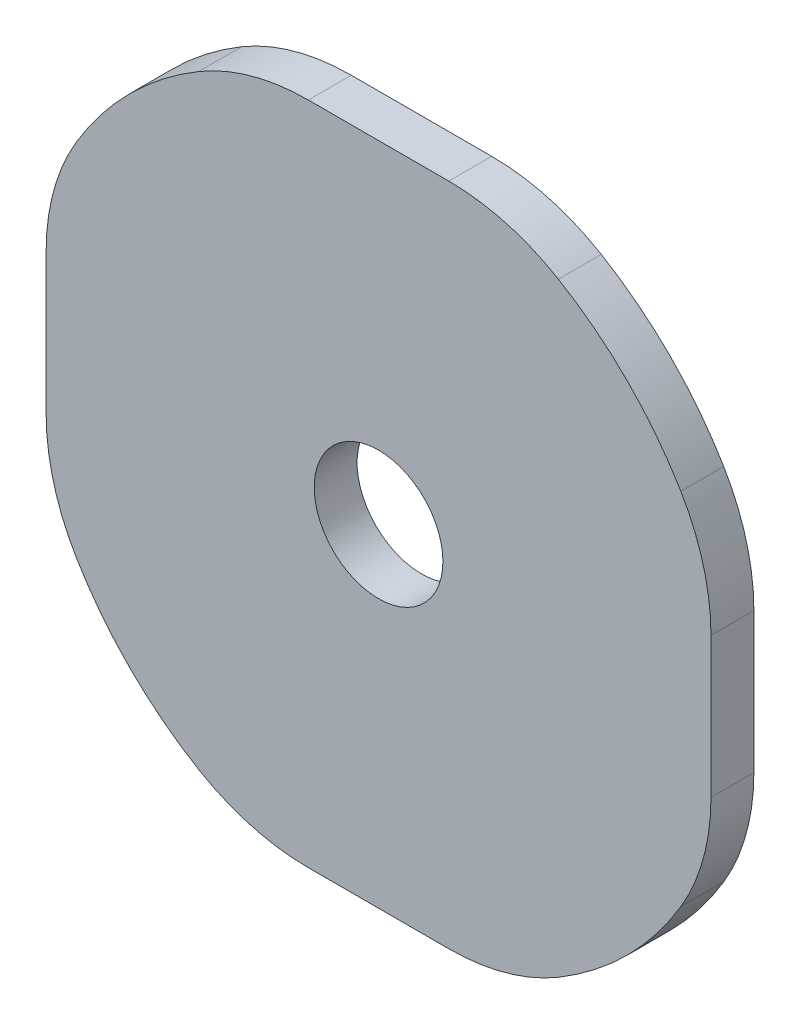
ISO-10303-21;
HEADER;
FILE_DESCRIPTION(('STEP AP214'),'2;1');
FILE_NAME('part.step','',(''),(''),'','','');
FILE_SCHEMA(('AUTOMOTIVE_DESIGN { 1 0 10303 214 1 1 1 1 }'));
ENDSEC;
DATA;
#1=APPLICATION_CONTEXT('core data for automotive mechanical design processes');
#2=APPLICATION_PROTOCOL_DEFINITION('international standard','automotive_design',2000,#1);
#3=PRODUCT_CONTEXT('',#1,'mechanical');
#4=PRODUCT('Part','Part','',(#3));
#5=PRODUCT_RELATED_PRODUCT_CATEGORY('part','',(#4));
#6=PRODUCT_DEFINITION_FORMATION('','',#4);
#7=PRODUCT_DEFINITION_CONTEXT('part definition',#1,'design');
#8=PRODUCT_DEFINITION('design','',#6,#7);
#9=PRODUCT_DEFINITION_SHAPE('','',#8);
#10=(LENGTH_UNIT() NAMED_UNIT(*) SI_UNIT(.MILLI.,.METRE.));
#11=(NAMED_UNIT(*) PLANE_ANGLE_UNIT() SI_UNIT($,.RADIAN.));
#12=(NAMED_UNIT(*) SI_UNIT($,.STERADIAN.) SOLID_ANGLE_UNIT());
#13=UNCERTAINTY_MEASURE_WITH_UNIT(LENGTH_MEASURE(1.E-05),#10,'distance_accuracy_value','');
#14=(GEOMETRIC_REPRESENTATION_CONTEXT(3) GLOBAL_UNCERTAINTY_ASSIGNED_CONTEXT((#13)) GLOBAL_UNIT_ASSIGNED_CONTEXT((#10,
#11,#12)) REPRESENTATION_CONTEXT('',''));
#15=CARTESIAN_POINT('',(0.,0.,0.));
#16=DIRECTION('',(0.,0.,1.));
#17=DIRECTION('',(1.,0.,0.));
#18=AXIS2_PLACEMENT_3D('',#15,#16,#17);
#19=CARTESIAN_POINT('',(0.,0.,2.));
#20=DIRECTION('',(0.,0.,-1.));
#21=DIRECTION('',(-1.,0.,0.));
#22=AXIS2_PLACEMENT_3D('',#19,#20,#21);
#23=CYLINDRICAL_SURFACE('',#22,16.4);
#24=CARTESIAN_POINT('',(0.,0.,2.));
#25=DIRECTION('',(0.,0.,1.));
#26=DIRECTION('',(1.,0.,0.));
#27=AXIS2_PLACEMENT_3D('',#24,#25,#26);
#28=CIRCLE('',#27,16.4);
#29=CARTESIAN_POINT('',(8.3860724381262,-14.09375,2.));
#30=VERTEX_POINT('',#29);
#31=CARTESIAN_POINT('',(14.09375,-8.3860724381262,2.));
#32=VERTEX_POINT('',#31);
#33=EDGE_CURVE('E269',#30,#32,#28,.T.);
#34=ORIENTED_EDGE('',*,*,#33,.F.);
#35=DIRECTION('',(0.,0.,-1.));
#36=VECTOR('',#35,1.);
#37=CARTESIAN_POINT('',(8.3860724381262,-14.09375,2.));
#38=LINE('',#37,#36);
#39=CARTESIAN_POINT('',(8.3860724381262,-14.09375,0.));
#40=VERTEX_POINT('',#39);
#41=EDGE_CURVE('E237',#30,#40,#38,.T.);
#42=ORIENTED_EDGE('',*,*,#41,.T.);
#43=CARTESIAN_POINT('',(0.,0.,0.));
#44=DIRECTION('',(0.,0.,1.));
#45=DIRECTION('',(1.,0.,0.));
#46=AXIS2_PLACEMENT_3D('',#43,#44,#45);
#47=CIRCLE('',#46,16.4);
#48=CARTESIAN_POINT('',(14.09375,-8.3860724381262,0.));
#49=VERTEX_POINT('',#48);
#50=EDGE_CURVE('E264',#40,#49,#47,.T.);
#51=ORIENTED_EDGE('',*,*,#50,.T.);
#52=DIRECTION('',(0.,0.,-1.));
#53=VECTOR('',#52,1.);
#54=CARTESIAN_POINT('',(14.09375,-8.3860724381262,2.));
#55=LINE('',#54,#53);
#56=EDGE_CURVE('E235',#49,#32,#55,.F.);
#57=ORIENTED_EDGE('',*,*,#56,.T.);
#58=EDGE_LOOP('',(#34,#42,#51,#57));
#59=FACE_BOUND('',#58,.T.);
#60=ADVANCED_FACE('F33',(#59),#23,.T.);
#61=CARTESIAN_POINT('',(14.09375,8.3860724381262,0.));
#62=VERTEX_POINT('',#61);
#63=CARTESIAN_POINT('',(8.3860724381262,14.09375,0.));
#64=VERTEX_POINT('',#63);
#65=EDGE_CURVE('E271',#62,#64,#47,.T.);
#66=ORIENTED_EDGE('',*,*,#65,.T.);
#67=DIRECTION('',(0.,0.,-1.));
#68=VECTOR('',#67,1.);
#69=CARTESIAN_POINT('',(8.3860724381262,14.09375,2.));
#70=LINE('',#69,#68);
#71=CARTESIAN_POINT('',(8.3860724381262,14.09375,2.));
#72=VERTEX_POINT('',#71);
#73=EDGE_CURVE('E154',#64,#72,#70,.F.);
#74=ORIENTED_EDGE('',*,*,#73,.T.);
#75=CARTESIAN_POINT('',(14.09375,8.3860724381262,2.));
#76=VERTEX_POINT('',#75);
#77=EDGE_CURVE('E270',#76,#72,#28,.T.);
#78=ORIENTED_EDGE('',*,*,#77,.F.);
#79=DIRECTION('',(0.,0.,-1.));
#80=VECTOR('',#79,1.);
#81=CARTESIAN_POINT('',(14.09375,8.3860724381262,2.));
#82=LINE('',#81,#80);
#83=EDGE_CURVE('E159',#76,#62,#82,.T.);
#84=ORIENTED_EDGE('',*,*,#83,.T.);
#85=EDGE_LOOP('',(#66,#74,#78,#84));
#86=FACE_BOUND('',#85,.T.);
#87=ADVANCED_FACE('F286',(#86),#23,.T.);
#88=CARTESIAN_POINT('',(-8.3860724381262,14.09375,2.));
#89=VERTEX_POINT('',#88);
#90=CARTESIAN_POINT('',(-14.09375,8.3860724381262,2.));
#91=VERTEX_POINT('',#90);
#92=EDGE_CURVE('E268',#89,#91,#28,.T.);
#93=ORIENTED_EDGE('',*,*,#92,.F.);
#94=DIRECTION('',(0.,0.,-1.));
#95=VECTOR('',#94,1.);
#96=CARTESIAN_POINT('',(-8.3860724381262,14.09375,2.));
#97=LINE('',#96,#95);
#98=CARTESIAN_POINT('',(-8.3860724381262,14.09375,0.));
#99=VERTEX_POINT('',#98);
#100=EDGE_CURVE('E218',#89,#99,#97,.T.);
#101=ORIENTED_EDGE('',*,*,#100,.T.);
#102=CARTESIAN_POINT('',(-14.09375,8.3860724381262,0.));
#103=VERTEX_POINT('',#102);
#104=EDGE_CURVE('E272',#99,#103,#47,.T.);
#105=ORIENTED_EDGE('',*,*,#104,.T.);
#106=DIRECTION('',(0.,0.,-1.));
#107=VECTOR('',#106,1.);
#108=CARTESIAN_POINT('',(-14.09375,8.3860724381262,2.));
#109=LINE('',#108,#107);
#110=EDGE_CURVE('E216',#103,#91,#109,.F.);
#111=ORIENTED_EDGE('',*,*,#110,.T.);
#112=EDGE_LOOP('',(#93,#101,#105,#111));
#113=FACE_BOUND('',#112,.T.);
#114=ADVANCED_FACE('F288',(#113),#23,.T.);
#115=CARTESIAN_POINT('',(-14.09375,-8.3860724381262,2.));
#116=VERTEX_POINT('',#115);
#117=CARTESIAN_POINT('',(-8.3860724381262,-14.09375,2.));
#118=VERTEX_POINT('',#117);
#119=EDGE_CURVE('E266',#116,#118,#28,.T.);
#120=ORIENTED_EDGE('',*,*,#119,.F.);
#121=DIRECTION('',(0.,0.,-1.));
#122=VECTOR('',#121,1.);
#123=CARTESIAN_POINT('',(-14.09375,-8.3860724381262,2.));
#124=LINE('',#123,#122);
#125=CARTESIAN_POINT('',(-14.09375,-8.3860724381262,0.));
#126=VERTEX_POINT('',#125);
#127=EDGE_CURVE('E228',#116,#126,#124,.T.);
#128=ORIENTED_EDGE('',*,*,#127,.T.);
#129=CARTESIAN_POINT('',(-8.3860724381262,-14.09375,0.));
#130=VERTEX_POINT('',#129);
#131=EDGE_CURVE('E465',#126,#130,#47,.T.);
#132=ORIENTED_EDGE('',*,*,#131,.T.);
#133=DIRECTION('',(0.,0.,-1.));
#134=VECTOR('',#133,1.);
#135=CARTESIAN_POINT('',(-8.3860724381262,-14.09375,2.));
#136=LINE('',#135,#134);
#137=EDGE_CURVE('E226',#130,#118,#136,.F.);
#138=ORIENTED_EDGE('',*,*,#137,.T.);
#139=EDGE_LOOP('',(#120,#128,#132,#138));
#140=FACE_BOUND('',#139,.T.);
#141=ADVANCED_FACE('F294',(#140),#23,.T.);
#142=CARTESIAN_POINT('',(0.,0.,2.));
#143=DIRECTION('',(0.,0.,1.));
#144=DIRECTION('',(1.,0.,0.));
#145=AXIS2_PLACEMENT_3D('',#142,#143,#144);
#146=PLANE('',#145);
#147=CARTESIAN_POINT('',(0.,0.,2.));
#148=DIRECTION('',(0.,0.,1.));
#149=DIRECTION('',(1.,0.,0.));
#150=AXIS2_PLACEMENT_3D('',#147,#148,#149);
#151=CIRCLE('',#150,3.);
#152=CARTESIAN_POINT('',(3.,0.,2.));
#153=VERTEX_POINT('',#152);
#154=EDGE_CURVE('E254',#153,#153,#151,.T.);
#155=ORIENTED_EDGE('',*,*,#154,.F.);
#156=EDGE_LOOP('',(#155));
#157=FACE_BOUND('',#156,.T.);
#158=ORIENTED_EDGE('',*,*,#77,.T.);
#159=CARTESIAN_POINT('',(3.27261363439071,5.5,2.));
#160=DIRECTION('',(0.,0.,1.));
#161=DIRECTION('',(1.,0.,0.));
#162=AXIS2_PLACEMENT_3D('',#159,#160,#161);
#163=CIRCLE('',#162,10.);
#164=CARTESIAN_POINT('',(3.27261363439071,15.5,2.));
#165=VERTEX_POINT('',#164);
#166=EDGE_CURVE('E214',#72,#165,#163,.T.);
#167=ORIENTED_EDGE('',*,*,#166,.T.);
#168=DIRECTION('',(-1.,0.,0.));
#169=VECTOR('',#168,1.);
#170=CARTESIAN_POINT('',(0.,15.5,2.));
#171=LINE('',#170,#169);
#172=CARTESIAN_POINT('',(-3.27261363439071,15.5,2.));
#173=VERTEX_POINT('',#172);
#174=EDGE_CURVE('E170',#165,#173,#171,.T.);
#175=ORIENTED_EDGE('',*,*,#174,.T.);
#176=CARTESIAN_POINT('',(-3.27261363439071,5.5,2.));
#177=DIRECTION('',(0.,0.,1.));
#178=DIRECTION('',(1.,0.,0.));
#179=AXIS2_PLACEMENT_3D('',#176,#177,#178);
#180=CIRCLE('',#179,10.);
#181=EDGE_CURVE('E212',#173,#89,#180,.T.);
#182=ORIENTED_EDGE('',*,*,#181,.T.);
#183=ORIENTED_EDGE('',*,*,#92,.T.);
#184=CARTESIAN_POINT('',(-5.5,3.27261363439071,2.));
#185=DIRECTION('',(0.,0.,1.));
#186=DIRECTION('',(1.,0.,0.));
#187=AXIS2_PLACEMENT_3D('',#184,#185,#186);
#188=CIRCLE('',#187,10.);
#189=CARTESIAN_POINT('',(-15.5,3.27261363439071,2.));
#190=VERTEX_POINT('',#189);
#191=EDGE_CURVE('E210',#91,#190,#188,.T.);
#192=ORIENTED_EDGE('',*,*,#191,.T.);
#193=DIRECTION('',(0.,-1.,0.));
#194=VECTOR('',#193,1.);
#195=CARTESIAN_POINT('',(-15.5,0.,2.));
#196=LINE('',#195,#194);
#197=CARTESIAN_POINT('',(-15.5,-3.27261363439071,2.));
#198=VERTEX_POINT('',#197);
#199=EDGE_CURVE('E259',#190,#198,#196,.T.);
#200=ORIENTED_EDGE('',*,*,#199,.T.);
#201=CARTESIAN_POINT('',(-5.5,-3.27261363439071,2.));
#202=DIRECTION('',(0.,0.,1.));
#203=DIRECTION('',(1.,0.,0.));
#204=AXIS2_PLACEMENT_3D('',#201,#202,#203);
#205=CIRCLE('',#204,10.);
#206=EDGE_CURVE('E208',#198,#116,#205,.T.);
#207=ORIENTED_EDGE('',*,*,#206,.T.);
#208=ORIENTED_EDGE('',*,*,#119,.T.);
#209=CARTESIAN_POINT('',(-3.27261363439071,-5.5,2.));
#210=DIRECTION('',(0.,0.,1.));
#211=DIRECTION('',(1.,0.,0.));
#212=AXIS2_PLACEMENT_3D('',#209,#210,#211);
#213=CIRCLE('',#212,10.);
#214=CARTESIAN_POINT('',(-3.27261363439071,-15.5,2.));
#215=VERTEX_POINT('',#214);
#216=EDGE_CURVE('E56',#118,#215,#213,.T.);
#217=ORIENTED_EDGE('',*,*,#216,.T.);
#218=DIRECTION('',(1.,0.,0.));
#219=VECTOR('',#218,1.);
#220=CARTESIAN_POINT('',(0.,-15.5,2.));
#221=LINE('',#220,#219);
#222=CARTESIAN_POINT('',(3.27261363439071,-15.5,2.));
#223=VERTEX_POINT('',#222);
#224=EDGE_CURVE('E475',#215,#223,#221,.T.);
#225=ORIENTED_EDGE('',*,*,#224,.T.);
#226=CARTESIAN_POINT('',(3.27261363439071,-5.5,2.));
#227=DIRECTION('',(0.,0.,1.));
#228=DIRECTION('',(1.,0.,0.));
#229=AXIS2_PLACEMENT_3D('',#226,#227,#228);
#230=CIRCLE('',#229,10.);
#231=EDGE_CURVE('E48',#223,#30,#230,.T.);
#232=ORIENTED_EDGE('',*,*,#231,.T.);
#233=ORIENTED_EDGE('',*,*,#33,.T.);
#234=CARTESIAN_POINT('',(5.5,-3.27261363439071,2.));
#235=DIRECTION('',(0.,0.,1.));
#236=DIRECTION('',(1.,0.,0.));
#237=AXIS2_PLACEMENT_3D('',#234,#235,#236);
#238=CIRCLE('',#237,10.);
#239=CARTESIAN_POINT('',(15.5,-3.27261363439071,2.));
#240=VERTEX_POINT('',#239);
#241=EDGE_CURVE('E204',#32,#240,#238,.T.);
#242=ORIENTED_EDGE('',*,*,#241,.T.);
#243=DIRECTION('',(0.,1.,0.));
#244=VECTOR('',#243,1.);
#245=CARTESIAN_POINT('',(15.5,0.,2.));
#246=LINE('',#245,#244);
#247=CARTESIAN_POINT('',(15.5,3.27261363439071,2.));
#248=VERTEX_POINT('',#247);
#249=EDGE_CURVE('E244',#240,#248,#246,.T.);
#250=ORIENTED_EDGE('',*,*,#249,.T.);
#251=CARTESIAN_POINT('',(5.5,3.27261363439071,2.));
#252=DIRECTION('',(0.,0.,1.));
#253=DIRECTION('',(1.,0.,0.));
#254=AXIS2_PLACEMENT_3D('',#251,#252,#253);
#255=CIRCLE('',#254,10.);
#256=EDGE_CURVE('E202',#248,#76,#255,.T.);
#257=ORIENTED_EDGE('',*,*,#256,.T.);
#258=EDGE_LOOP('',(#158,#167,#175,#182,#183,#192,#200,#207,#208,#217,#225,#232,#233,#242,#250,#257));
#259=FACE_BOUND('',#258,.T.);
#260=ADVANCED_FACE('F250',(#157,#259),#146,.T.);
#261=CARTESIAN_POINT('',(0.,0.,0.));
#262=DIRECTION('',(0.,0.,1.));
#263=DIRECTION('',(1.,0.,0.));
#264=AXIS2_PLACEMENT_3D('',#261,#262,#263);
#265=PLANE('',#264);
#266=CARTESIAN_POINT('',(0.,0.,0.));
#267=DIRECTION('',(0.,0.,1.));
#268=DIRECTION('',(1.,0.,0.));
#269=AXIS2_PLACEMENT_3D('',#266,#267,#268);
#270=CIRCLE('',#269,3.);
#271=CARTESIAN_POINT('',(3.,0.,0.));
#272=VERTEX_POINT('',#271);
#273=EDGE_CURVE('E257',#272,#272,#270,.T.);
#274=ORIENTED_EDGE('',*,*,#273,.T.);
#275=EDGE_LOOP('',(#274));
#276=FACE_BOUND('',#275,.T.);
#277=DIRECTION('',(-1.,0.,0.));
#278=VECTOR('',#277,1.);
#279=CARTESIAN_POINT('',(0.,15.5,0.));
#280=LINE('',#279,#278);
#281=CARTESIAN_POINT('',(3.27261363439071,15.5,0.));
#282=VERTEX_POINT('',#281);
#283=CARTESIAN_POINT('',(-3.27261363439071,15.5,0.));
#284=VERTEX_POINT('',#283);
#285=EDGE_CURVE('E167',#282,#284,#280,.T.);
#286=ORIENTED_EDGE('',*,*,#285,.F.);
#287=CARTESIAN_POINT('',(3.27261363439071,5.5,0.));
#288=DIRECTION('',(0.,0.,1.));
#289=DIRECTION('',(1.,0.,0.));
#290=AXIS2_PLACEMENT_3D('',#287,#288,#289);
#291=CIRCLE('',#290,10.);
#292=EDGE_CURVE('E149',#282,#64,#291,.F.);
#293=ORIENTED_EDGE('',*,*,#292,.T.);
#294=ORIENTED_EDGE('',*,*,#65,.F.);
#295=CARTESIAN_POINT('',(5.5,3.27261363439071,0.));
#296=DIRECTION('',(0.,0.,1.));
#297=DIRECTION('',(1.,0.,0.));
#298=AXIS2_PLACEMENT_3D('',#295,#296,#297);
#299=CIRCLE('',#298,10.);
#300=CARTESIAN_POINT('',(15.5,3.27261363439071,0.));
#301=VERTEX_POINT('',#300);
#302=EDGE_CURVE('E171',#62,#301,#299,.F.);
#303=ORIENTED_EDGE('',*,*,#302,.T.);
#304=DIRECTION('',(0.,1.,0.));
#305=VECTOR('',#304,1.);
#306=CARTESIAN_POINT('',(15.5,0.,0.));
#307=LINE('',#306,#305);
#308=CARTESIAN_POINT('',(15.5,-3.27261363439071,0.));
#309=VERTEX_POINT('',#308);
#310=EDGE_CURVE('E177',#309,#301,#307,.T.);
#311=ORIENTED_EDGE('',*,*,#310,.F.);
#312=CARTESIAN_POINT('',(5.5,-3.27261363439071,0.));
#313=DIRECTION('',(0.,0.,1.));
#314=DIRECTION('',(1.,0.,0.));
#315=AXIS2_PLACEMENT_3D('',#312,#313,#314);
#316=CIRCLE('',#315,10.);
#317=EDGE_CURVE('E189',#309,#49,#316,.F.);
#318=ORIENTED_EDGE('',*,*,#317,.T.);
#319=ORIENTED_EDGE('',*,*,#50,.F.);
#320=CARTESIAN_POINT('',(3.27261363439071,-5.5,0.));
#321=DIRECTION('',(0.,0.,1.));
#322=DIRECTION('',(1.,0.,0.));
#323=AXIS2_PLACEMENT_3D('',#320,#321,#322);
#324=CIRCLE('',#323,10.);
#325=CARTESIAN_POINT('',(3.27261363439071,-15.5,0.));
#326=VERTEX_POINT('',#325);
#327=EDGE_CURVE('E191',#40,#326,#324,.F.);
#328=ORIENTED_EDGE('',*,*,#327,.T.);
#329=DIRECTION('',(1.,0.,0.));
#330=VECTOR('',#329,1.);
#331=CARTESIAN_POINT('',(0.,-15.5,0.));
#332=LINE('',#331,#330);
#333=CARTESIAN_POINT('',(-3.27261363439071,-15.5,0.));
#334=VERTEX_POINT('',#333);
#335=EDGE_CURVE('E183',#334,#326,#332,.T.);
#336=ORIENTED_EDGE('',*,*,#335,.F.);
#337=CARTESIAN_POINT('',(-3.27261363439071,-5.5,0.));
#338=DIRECTION('',(0.,0.,1.));
#339=DIRECTION('',(1.,0.,0.));
#340=AXIS2_PLACEMENT_3D('',#337,#338,#339);
#341=CIRCLE('',#340,10.);
#342=EDGE_CURVE('E193',#334,#130,#341,.F.);
#343=ORIENTED_EDGE('',*,*,#342,.T.);
#344=ORIENTED_EDGE('',*,*,#131,.F.);
#345=CARTESIAN_POINT('',(-5.5,-3.27261363439071,0.));
#346=DIRECTION('',(0.,0.,1.));
#347=DIRECTION('',(1.,0.,0.));
#348=AXIS2_PLACEMENT_3D('',#345,#346,#347);
#349=CIRCLE('',#348,10.);
#350=CARTESIAN_POINT('',(-15.5,-3.27261363439071,0.));
#351=VERTEX_POINT('',#350);
#352=EDGE_CURVE('E195',#126,#351,#349,.F.);
#353=ORIENTED_EDGE('',*,*,#352,.T.);
#354=DIRECTION('',(0.,-1.,0.));
#355=VECTOR('',#354,1.);
#356=CARTESIAN_POINT('',(-15.5,0.,0.));
#357=LINE('',#356,#355);
#358=CARTESIAN_POINT('',(-15.5,3.27261363439071,0.));
#359=VERTEX_POINT('',#358);
#360=EDGE_CURVE('E178',#359,#351,#357,.T.);
#361=ORIENTED_EDGE('',*,*,#360,.F.);
#362=CARTESIAN_POINT('',(-5.5,3.27261363439071,0.));
#363=DIRECTION('',(0.,0.,1.));
#364=DIRECTION('',(1.,0.,0.));
#365=AXIS2_PLACEMENT_3D('',#362,#363,#364);
#366=CIRCLE('',#365,10.);
#367=EDGE_CURVE('E197',#359,#103,#366,.F.);
#368=ORIENTED_EDGE('',*,*,#367,.T.);
#369=ORIENTED_EDGE('',*,*,#104,.F.);
#370=CARTESIAN_POINT('',(-3.27261363439071,5.5,0.));
#371=DIRECTION('',(0.,0.,1.));
#372=DIRECTION('',(1.,0.,0.));
#373=AXIS2_PLACEMENT_3D('',#370,#371,#372);
#374=CIRCLE('',#373,10.);
#375=EDGE_CURVE('E160',#99,#284,#374,.F.);
#376=ORIENTED_EDGE('',*,*,#375,.T.);
#377=EDGE_LOOP('',(#286,#293,#294,#303,#311,#318,#319,#328,#336,#343,#344,#353,#361,#368,#369,#376));
#378=FACE_BOUND('',#377,.T.);
#379=ADVANCED_FACE('F174',(#276,#378),#265,.F.);
#380=CARTESIAN_POINT('',(0.,0.,0.));
#381=DIRECTION('',(0.,0.,1.));
#382=DIRECTION('',(1.,0.,0.));
#383=AXIS2_PLACEMENT_3D('',#380,#381,#382);
#384=CYLINDRICAL_SURFACE('',#383,3.);
#385=ORIENTED_EDGE('',*,*,#273,.F.);
#386=EDGE_LOOP('',(#385));
#387=FACE_BOUND('',#386,.T.);
#388=ORIENTED_EDGE('',*,*,#154,.T.);
#389=EDGE_LOOP('',(#388));
#390=FACE_BOUND('',#389,.T.);
#391=ADVANCED_FACE('F401',(#387,#390),#384,.F.);
#392=CARTESIAN_POINT('',(15.5,-15.5,10.));
#393=DIRECTION('',(0.,-1.,0.));
#394=DIRECTION('',(0.,0.,-1.));
#395=AXIS2_PLACEMENT_3D('',#392,#393,#394);
#396=PLANE('',#395);
#397=ORIENTED_EDGE('',*,*,#224,.F.);
#398=DIRECTION('',(0.,0.,1.));
#399=VECTOR('',#398,1.);
#400=CARTESIAN_POINT('',(-3.27261363439071,-15.5,0.));
#401=LINE('',#400,#399);
#402=EDGE_CURVE('E232',#215,#334,#401,.F.);
#403=ORIENTED_EDGE('',*,*,#402,.T.);
#404=ORIENTED_EDGE('',*,*,#335,.T.);
#405=DIRECTION('',(0.,0.,1.));
#406=VECTOR('',#405,1.);
#407=CARTESIAN_POINT('',(3.27261363439071,-15.5,2.));
#408=LINE('',#407,#406);
#409=EDGE_CURVE('E230',#326,#223,#408,.T.);
#410=ORIENTED_EDGE('',*,*,#409,.T.);
#411=EDGE_LOOP('',(#397,#403,#404,#410));
#412=FACE_BOUND('',#411,.T.);
#413=ADVANCED_FACE('F391',(#412),#396,.T.);
#414=CARTESIAN_POINT('',(-15.5,15.5,10.));
#415=DIRECTION('',(-1.,0.,0.));
#416=DIRECTION('',(0.,0.,1.));
#417=AXIS2_PLACEMENT_3D('',#414,#415,#416);
#418=PLANE('',#417);
#419=ORIENTED_EDGE('',*,*,#199,.F.);
#420=DIRECTION('',(0.,0.,1.));
#421=VECTOR('',#420,1.);
#422=CARTESIAN_POINT('',(-15.5,3.27261363439071,0.));
#423=LINE('',#422,#421);
#424=EDGE_CURVE('E223',#190,#359,#423,.F.);
#425=ORIENTED_EDGE('',*,*,#424,.T.);
#426=ORIENTED_EDGE('',*,*,#360,.T.);
#427=DIRECTION('',(0.,0.,1.));
#428=VECTOR('',#427,1.);
#429=CARTESIAN_POINT('',(-15.5,-3.27261363439071,2.));
#430=LINE('',#429,#428);
#431=EDGE_CURVE('E220',#351,#198,#430,.T.);
#432=ORIENTED_EDGE('',*,*,#431,.T.);
#433=EDGE_LOOP('',(#419,#425,#426,#432));
#434=FACE_BOUND('',#433,.T.);
#435=ADVANCED_FACE('F382',(#434),#418,.T.);
#436=CARTESIAN_POINT('',(15.5,15.5,10.));
#437=DIRECTION('',(0.,1.,0.));
#438=DIRECTION('',(0.,0.,1.));
#439=AXIS2_PLACEMENT_3D('',#436,#437,#438);
#440=PLANE('',#439);
#441=ORIENTED_EDGE('',*,*,#174,.F.);
#442=DIRECTION('',(0.,0.,1.));
#443=VECTOR('',#442,1.);
#444=CARTESIAN_POINT('',(3.27261363439071,15.5,0.));
#445=LINE('',#444,#443);
#446=EDGE_CURVE('E153',#165,#282,#445,.F.);
#447=ORIENTED_EDGE('',*,*,#446,.T.);
#448=ORIENTED_EDGE('',*,*,#285,.T.);
#449=DIRECTION('',(0.,0.,1.));
#450=VECTOR('',#449,1.);
#451=CARTESIAN_POINT('',(-3.27261363439071,15.5,2.));
#452=LINE('',#451,#450);
#453=EDGE_CURVE('E172',#284,#173,#452,.T.);
#454=ORIENTED_EDGE('',*,*,#453,.T.);
#455=EDGE_LOOP('',(#441,#447,#448,#454));
#456=FACE_BOUND('',#455,.T.);
#457=ADVANCED_FACE('F165',(#456),#440,.T.);
#458=CARTESIAN_POINT('',(15.5,15.5,10.));
#459=DIRECTION('',(1.,0.,0.));
#460=DIRECTION('',(0.,0.,-1.));
#461=AXIS2_PLACEMENT_3D('',#458,#459,#460);
#462=PLANE('',#461);
#463=ORIENTED_EDGE('',*,*,#249,.F.);
#464=DIRECTION('',(0.,0.,1.));
#465=VECTOR('',#464,1.);
#466=CARTESIAN_POINT('',(15.5,-3.27261363439071,0.));
#467=LINE('',#466,#465);
#468=EDGE_CURVE('E11',#240,#309,#467,.F.);
#469=ORIENTED_EDGE('',*,*,#468,.T.);
#470=ORIENTED_EDGE('',*,*,#310,.T.);
#471=DIRECTION('',(0.,0.,1.));
#472=VECTOR('',#471,1.);
#473=CARTESIAN_POINT('',(15.5,3.27261363439071,2.));
#474=LINE('',#473,#472);
#475=EDGE_CURVE('E41',#301,#248,#474,.T.);
#476=ORIENTED_EDGE('',*,*,#475,.T.);
#477=EDGE_LOOP('',(#463,#469,#470,#476));
#478=FACE_BOUND('',#477,.T.);
#479=ADVANCED_FACE('F243',(#478),#462,.T.);
#480=CARTESIAN_POINT('',(3.27261363439071,5.5,2.));
#481=DIRECTION('',(0.,0.,-1.));
#482=DIRECTION('',(-1.,0.,0.));
#483=AXIS2_PLACEMENT_3D('',#480,#481,#482);
#484=CYLINDRICAL_SURFACE('',#483,10.);
#485=ORIENTED_EDGE('',*,*,#166,.F.);
#486=ORIENTED_EDGE('',*,*,#73,.F.);
#487=ORIENTED_EDGE('',*,*,#292,.F.);
#488=ORIENTED_EDGE('',*,*,#446,.F.);
#489=EDGE_LOOP('',(#485,#486,#487,#488));
#490=FACE_BOUND('',#489,.T.);
#491=ADVANCED_FACE('F152',(#490),#484,.T.);
#492=CARTESIAN_POINT('',(-3.27261363439071,5.5,2.));
#493=DIRECTION('',(0.,0.,-1.));
#494=DIRECTION('',(-1.,0.,0.));
#495=AXIS2_PLACEMENT_3D('',#492,#493,#494);
#496=CYLINDRICAL_SURFACE('',#495,10.);
#497=ORIENTED_EDGE('',*,*,#375,.F.);
#498=ORIENTED_EDGE('',*,*,#100,.F.);
#499=ORIENTED_EDGE('',*,*,#181,.F.);
#500=ORIENTED_EDGE('',*,*,#453,.F.);
#501=EDGE_LOOP('',(#497,#498,#499,#500));
#502=FACE_BOUND('',#501,.T.);
#503=ADVANCED_FACE('F301',(#502),#496,.T.);
#504=CARTESIAN_POINT('',(-5.5,3.27261363439071,2.));
#505=DIRECTION('',(0.,0.,-1.));
#506=DIRECTION('',(-1.,0.,0.));
#507=AXIS2_PLACEMENT_3D('',#504,#505,#506);
#508=CYLINDRICAL_SURFACE('',#507,10.);
#509=ORIENTED_EDGE('',*,*,#191,.F.);
#510=ORIENTED_EDGE('',*,*,#110,.F.);
#511=ORIENTED_EDGE('',*,*,#367,.F.);
#512=ORIENTED_EDGE('',*,*,#424,.F.);
#513=EDGE_LOOP('',(#509,#510,#511,#512));
#514=FACE_BOUND('',#513,.T.);
#515=ADVANCED_FACE('F304',(#514),#508,.T.);
#516=CARTESIAN_POINT('',(-5.5,-3.27261363439071,2.));
#517=DIRECTION('',(0.,0.,-1.));
#518=DIRECTION('',(-1.,0.,0.));
#519=AXIS2_PLACEMENT_3D('',#516,#517,#518);
#520=CYLINDRICAL_SURFACE('',#519,10.);
#521=ORIENTED_EDGE('',*,*,#352,.F.);
#522=ORIENTED_EDGE('',*,*,#127,.F.);
#523=ORIENTED_EDGE('',*,*,#206,.F.);
#524=ORIENTED_EDGE('',*,*,#431,.F.);
#525=EDGE_LOOP('',(#521,#522,#523,#524));
#526=FACE_BOUND('',#525,.T.);
#527=ADVANCED_FACE('F308',(#526),#520,.T.);
#528=CARTESIAN_POINT('',(-3.27261363439071,-5.5,2.));
#529=DIRECTION('',(0.,0.,-1.));
#530=DIRECTION('',(-1.,0.,0.));
#531=AXIS2_PLACEMENT_3D('',#528,#529,#530);
#532=CYLINDRICAL_SURFACE('',#531,10.);
#533=ORIENTED_EDGE('',*,*,#216,.F.);
#534=ORIENTED_EDGE('',*,*,#137,.F.);
#535=ORIENTED_EDGE('',*,*,#342,.F.);
#536=ORIENTED_EDGE('',*,*,#402,.F.);
#537=EDGE_LOOP('',(#533,#534,#535,#536));
#538=FACE_BOUND('',#537,.T.);
#539=ADVANCED_FACE('F312',(#538),#532,.T.);
#540=CARTESIAN_POINT('',(3.27261363439071,-5.5,2.));
#541=DIRECTION('',(0.,0.,-1.));
#542=DIRECTION('',(-1.,0.,0.));
#543=AXIS2_PLACEMENT_3D('',#540,#541,#542);
#544=CYLINDRICAL_SURFACE('',#543,10.);
#545=ORIENTED_EDGE('',*,*,#327,.F.);
#546=ORIENTED_EDGE('',*,*,#41,.F.);
#547=ORIENTED_EDGE('',*,*,#231,.F.);
#548=ORIENTED_EDGE('',*,*,#409,.F.);
#549=EDGE_LOOP('',(#545,#546,#547,#548));
#550=FACE_BOUND('',#549,.T.);
#551=ADVANCED_FACE('F316',(#550),#544,.T.);
#552=CARTESIAN_POINT('',(5.5,-3.27261363439071,2.));
#553=DIRECTION('',(0.,0.,-1.));
#554=DIRECTION('',(-1.,0.,0.));
#555=AXIS2_PLACEMENT_3D('',#552,#553,#554);
#556=CYLINDRICAL_SURFACE('',#555,10.);
#557=ORIENTED_EDGE('',*,*,#241,.F.);
#558=ORIENTED_EDGE('',*,*,#56,.F.);
#559=ORIENTED_EDGE('',*,*,#317,.F.);
#560=ORIENTED_EDGE('',*,*,#468,.F.);
#561=EDGE_LOOP('',(#557,#558,#559,#560));
#562=FACE_BOUND('',#561,.T.);
#563=ADVANCED_FACE('F281',(#562),#556,.T.);
#564=CARTESIAN_POINT('',(5.5,3.27261363439071,2.));
#565=DIRECTION('',(0.,0.,-1.));
#566=DIRECTION('',(-1.,0.,0.));
#567=AXIS2_PLACEMENT_3D('',#564,#565,#566);
#568=CYLINDRICAL_SURFACE('',#567,10.);
#569=ORIENTED_EDGE('',*,*,#302,.F.);
#570=ORIENTED_EDGE('',*,*,#83,.F.);
#571=ORIENTED_EDGE('',*,*,#256,.F.);
#572=ORIENTED_EDGE('',*,*,#475,.F.);
#573=EDGE_LOOP('',(#569,#570,#571,#572));
#574=FACE_BOUND('',#573,.T.);
#575=ADVANCED_FACE('F35',(#574),#568,.T.);
#576=CLOSED_SHELL('',(#60,#87,#114,#141,#260,#379,#391,#413,#435,#457,#479,#491,#503,#515,#527,
#539,#551,#563,#575));
#577=MANIFOLD_SOLID_BREP('B2',#576);
#578=ADVANCED_BREP_SHAPE_REPRESENTATION('',(#18,#577),#14);
#579=SHAPE_DEFINITION_REPRESENTATION(#9,#578);
ENDSEC;
END-ISO-10303-21;
